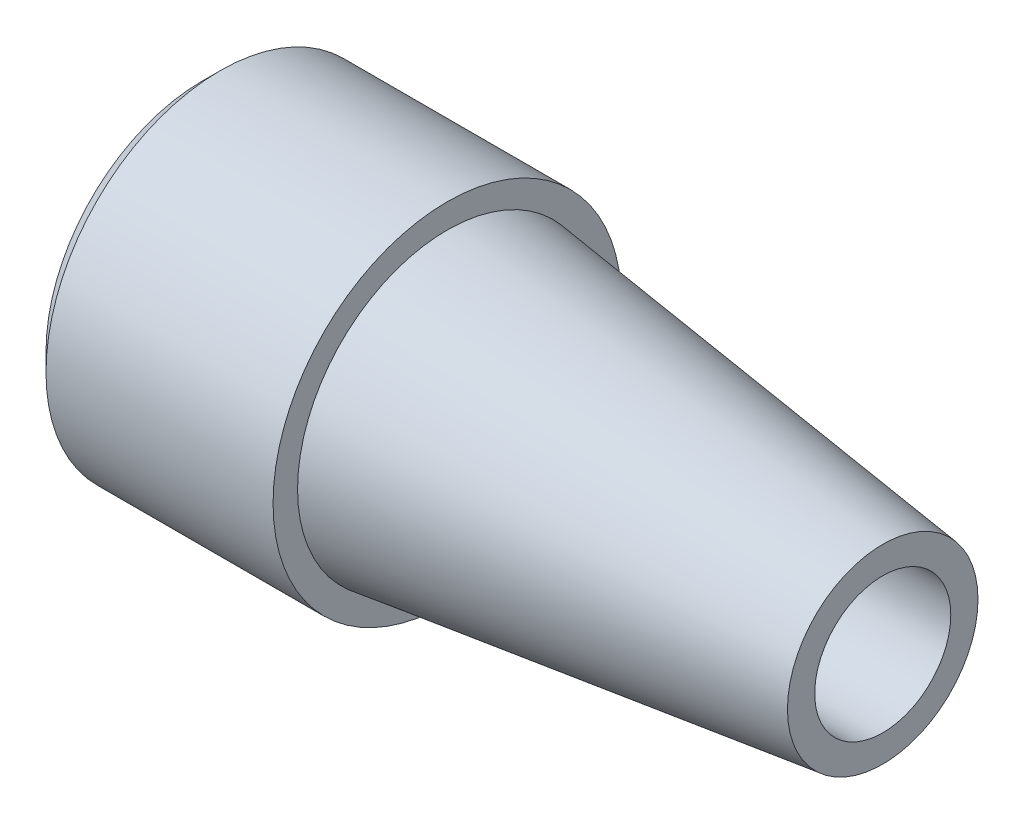
ISO-10303-21;
HEADER;
FILE_DESCRIPTION(('STEP AP214'),'2;1');
FILE_NAME('part.step','',(''),(''),'','','');
FILE_SCHEMA(('AUTOMOTIVE_DESIGN { 1 0 10303 214 1 1 1 1 }'));
ENDSEC;
DATA;
#1=APPLICATION_CONTEXT('core data for automotive mechanical design processes');
#2=APPLICATION_PROTOCOL_DEFINITION('international standard','automotive_design',2000,#1);
#3=PRODUCT_CONTEXT('',#1,'mechanical');
#4=PRODUCT('Part','Part','',(#3));
#5=PRODUCT_RELATED_PRODUCT_CATEGORY('part','',(#4));
#6=PRODUCT_DEFINITION_FORMATION('','',#4);
#7=PRODUCT_DEFINITION_CONTEXT('part definition',#1,'design');
#8=PRODUCT_DEFINITION('design','',#6,#7);
#9=PRODUCT_DEFINITION_SHAPE('','',#8);
#10=(LENGTH_UNIT() NAMED_UNIT(*) SI_UNIT(.MILLI.,.METRE.));
#11=(NAMED_UNIT(*) PLANE_ANGLE_UNIT() SI_UNIT($,.RADIAN.));
#12=(NAMED_UNIT(*) SI_UNIT($,.STERADIAN.) SOLID_ANGLE_UNIT());
#13=UNCERTAINTY_MEASURE_WITH_UNIT(LENGTH_MEASURE(1.E-05),#10,'distance_accuracy_value','');
#14=(GEOMETRIC_REPRESENTATION_CONTEXT(3) GLOBAL_UNCERTAINTY_ASSIGNED_CONTEXT((#13)) GLOBAL_UNIT_ASSIGNED_CONTEXT((#10,
#11,#12)) REPRESENTATION_CONTEXT('',''));
#15=CARTESIAN_POINT('',(0.,0.,0.));
#16=DIRECTION('',(0.,0.,1.));
#17=DIRECTION('',(1.,0.,0.));
#18=AXIS2_PLACEMENT_3D('',#15,#16,#17);
#19=CARTESIAN_POINT('',(0.,0.,0.));
#20=DIRECTION('',(-1.,0.,0.));
#21=DIRECTION('',(0.,0.,1.));
#22=AXIS2_PLACEMENT_3D('',#19,#20,#21);
#23=CONICAL_SURFACE('',#22,17.5,0.124354994546761);
#24=CARTESIAN_POINT('',(-80.,0.,0.));
#25=DIRECTION('',(-1.,0.,0.));
#26=DIRECTION('',(0.,0.,1.));
#27=AXIS2_PLACEMENT_3D('',#24,#25,#26);
#28=CIRCLE('',#27,27.5);
#29=CARTESIAN_POINT('',(-80.,0.,27.5));
#30=VERTEX_POINT('',#29);
#31=EDGE_CURVE('E65',#30,#30,#28,.T.);
#32=ORIENTED_EDGE('',*,*,#31,.F.);
#33=EDGE_LOOP('',(#32));
#34=FACE_BOUND('',#33,.T.);
#35=CARTESIAN_POINT('',(0.,0.,0.));
#36=DIRECTION('',(1.,0.,0.));
#37=DIRECTION('',(0.,0.,-1.));
#38=AXIS2_PLACEMENT_3D('',#35,#36,#37);
#39=CIRCLE('',#38,17.5);
#40=CARTESIAN_POINT('',(0.,0.,-17.5));
#41=VERTEX_POINT('',#40);
#42=EDGE_CURVE('E47',#41,#41,#39,.T.);
#43=ORIENTED_EDGE('',*,*,#42,.F.);
#44=EDGE_LOOP('',(#43));
#45=FACE_BOUND('',#44,.T.);
#46=ADVANCED_FACE('F36',(#34,#45),#23,.T.);
#47=CARTESIAN_POINT('',(0.,17.5,0.));
#48=DIRECTION('',(1.,0.,0.));
#49=DIRECTION('',(0.,0.,-1.));
#50=AXIS2_PLACEMENT_3D('',#47,#48,#49);
#51=PLANE('',#50);
#52=ORIENTED_EDGE('',*,*,#42,.T.);
#53=EDGE_LOOP('',(#52));
#54=FACE_BOUND('',#53,.T.);
#55=CARTESIAN_POINT('',(0.,0.,0.));
#56=DIRECTION('',(1.,0.,0.));
#57=DIRECTION('',(0.,0.,-1.));
#58=AXIS2_PLACEMENT_3D('',#55,#56,#57);
#59=CIRCLE('',#58,12.5);
#60=CARTESIAN_POINT('',(0.,0.,-12.5));
#61=VERTEX_POINT('',#60);
#62=EDGE_CURVE('E51',#61,#61,#59,.T.);
#63=ORIENTED_EDGE('',*,*,#62,.F.);
#64=EDGE_LOOP('',(#63));
#65=FACE_BOUND('',#64,.T.);
#66=ADVANCED_FACE('F74',(#54,#65),#51,.T.);
#67=CARTESIAN_POINT('',(0.,0.,0.));
#68=DIRECTION('',(1.,0.,0.));
#69=DIRECTION('',(0.,0.,-1.));
#70=AXIS2_PLACEMENT_3D('',#67,#68,#69);
#71=CYLINDRICAL_SURFACE('',#70,12.5);
#72=ORIENTED_EDGE('',*,*,#62,.T.);
#73=EDGE_LOOP('',(#72));
#74=FACE_BOUND('',#73,.T.);
#75=CARTESIAN_POINT('',(-77.2727272727273,0.,0.));
#76=DIRECTION('',(1.,0.,0.));
#77=DIRECTION('',(0.,0.,-1.));
#78=AXIS2_PLACEMENT_3D('',#75,#76,#77);
#79=CIRCLE('',#78,12.5);
#80=CARTESIAN_POINT('',(-77.2727272727273,0.,-12.5));
#81=VERTEX_POINT('',#80);
#82=EDGE_CURVE('E56',#81,#81,#79,.T.);
#83=ORIENTED_EDGE('',*,*,#82,.F.);
#84=EDGE_LOOP('',(#83));
#85=FACE_BOUND('',#84,.T.);
#86=ADVANCED_FACE('F79',(#74,#85),#71,.F.);
#87=CARTESIAN_POINT('',(-125.,0.,0.));
#88=DIRECTION('',(-1.,0.,0.));
#89=DIRECTION('',(0.,0.,1.));
#90=AXIS2_PLACEMENT_3D('',#87,#88,#89);
#91=CONICAL_SURFACE('',#90,25.,0.256151382565603);
#92=ORIENTED_EDGE('',*,*,#82,.T.);
#93=EDGE_LOOP('',(#92));
#94=FACE_BOUND('',#93,.T.);
#95=CARTESIAN_POINT('',(-125.,0.,0.));
#96=DIRECTION('',(1.,0.,0.));
#97=DIRECTION('',(0.,0.,-1.));
#98=AXIS2_PLACEMENT_3D('',#95,#96,#97);
#99=CIRCLE('',#98,25.);
#100=CARTESIAN_POINT('',(-125.,0.,-25.));
#101=VERTEX_POINT('',#100);
#102=EDGE_CURVE('E59',#101,#101,#99,.T.);
#103=ORIENTED_EDGE('',*,*,#102,.F.);
#104=EDGE_LOOP('',(#103));
#105=FACE_BOUND('',#104,.T.);
#106=ADVANCED_FACE('F85',(#94,#105),#91,.F.);
#107=CARTESIAN_POINT('',(-125.,27.5,0.));
#108=DIRECTION('',(-1.,0.,0.));
#109=DIRECTION('',(0.,0.,1.));
#110=AXIS2_PLACEMENT_3D('',#107,#108,#109);
#111=PLANE('',#110);
#112=CARTESIAN_POINT('',(-125.,0.,0.));
#113=DIRECTION('',(-1.,0.,0.));
#114=DIRECTION('',(0.,0.,1.));
#115=AXIS2_PLACEMENT_3D('',#112,#113,#114);
#116=CIRCLE('',#115,28.7125000000001);
#117=CARTESIAN_POINT('',(-125.,0.,28.7125000000001));
#118=VERTEX_POINT('',#117);
#119=EDGE_CURVE('E43',#118,#118,#116,.T.);
#120=ORIENTED_EDGE('',*,*,#119,.T.);
#121=EDGE_LOOP('',(#120));
#122=FACE_BOUND('',#121,.T.);
#123=ORIENTED_EDGE('',*,*,#102,.T.);
#124=EDGE_LOOP('',(#123));
#125=FACE_BOUND('',#124,.T.);
#126=ADVANCED_FACE('F91',(#122,#125),#111,.T.);
#127=CARTESIAN_POINT('',(-80.,0.,0.));
#128=DIRECTION('',(-1.,0.,0.));
#129=DIRECTION('',(0.,0.,1.));
#130=AXIS2_PLACEMENT_3D('',#127,#128,#129);
#131=CYLINDRICAL_SURFACE('',#130,32.);
#132=CARTESIAN_POINT('',(-121.7125,0.,0.));
#133=DIRECTION('',(-1.,0.,0.));
#134=DIRECTION('',(0.,0.,1.));
#135=AXIS2_PLACEMENT_3D('',#132,#133,#134);
#136=CIRCLE('',#135,32.);
#137=CARTESIAN_POINT('',(-121.7125,0.,32.));
#138=VERTEX_POINT('',#137);
#139=EDGE_CURVE('E10',#138,#138,#136,.F.);
#140=ORIENTED_EDGE('',*,*,#139,.T.);
#141=EDGE_LOOP('',(#140));
#142=FACE_BOUND('',#141,.T.);
#143=CARTESIAN_POINT('',(-80.,0.,0.));
#144=DIRECTION('',(-1.,0.,0.));
#145=DIRECTION('',(0.,0.,1.));
#146=AXIS2_PLACEMENT_3D('',#143,#144,#145);
#147=CIRCLE('',#146,32.);
#148=CARTESIAN_POINT('',(-80.,0.,32.));
#149=VERTEX_POINT('',#148);
#150=EDGE_CURVE('E62',#149,#149,#147,.T.);
#151=ORIENTED_EDGE('',*,*,#150,.T.);
#152=EDGE_LOOP('',(#151));
#153=FACE_BOUND('',#152,.T.);
#154=ADVANCED_FACE('F96',(#142,#153),#131,.T.);
#155=CARTESIAN_POINT('',(-80.,0.,0.));
#156=DIRECTION('',(-1.,0.,0.));
#157=DIRECTION('',(0.,0.,1.));
#158=AXIS2_PLACEMENT_3D('',#155,#156,#157);
#159=PLANE('',#158);
#160=ORIENTED_EDGE('',*,*,#31,.T.);
#161=EDGE_LOOP('',(#160));
#162=FACE_BOUND('',#161,.T.);
#163=ORIENTED_EDGE('',*,*,#150,.F.);
#164=EDGE_LOOP('',(#163));
#165=FACE_BOUND('',#164,.T.);
#166=ADVANCED_FACE('F69',(#162,#165),#159,.F.);
#167=CARTESIAN_POINT('',(-125.,0.,0.));
#168=DIRECTION('',(1.,0.,0.));
#169=DIRECTION('',(0.,0.,-1.));
#170=AXIS2_PLACEMENT_3D('',#167,#168,#169);
#171=CONICAL_SURFACE('',#170,28.7125000000001,0.785398163397447);
#172=ORIENTED_EDGE('',*,*,#139,.F.);
#173=EDGE_LOOP('',(#172));
#174=FACE_BOUND('',#173,.T.);
#175=ORIENTED_EDGE('',*,*,#119,.F.);
#176=EDGE_LOOP('',(#175));
#177=FACE_BOUND('',#176,.T.);
#178=ADVANCED_FACE('F38',(#174,#177),#171,.T.);
#179=CLOSED_SHELL('',(#46,#66,#86,#106,#126,#154,#166,#178));
#180=MANIFOLD_SOLID_BREP('B2',#179);
#181=ADVANCED_BREP_SHAPE_REPRESENTATION('',(#18,#180),#14);
#182=SHAPE_DEFINITION_REPRESENTATION(#9,#181);
ENDSEC;
END-ISO-10303-21;
